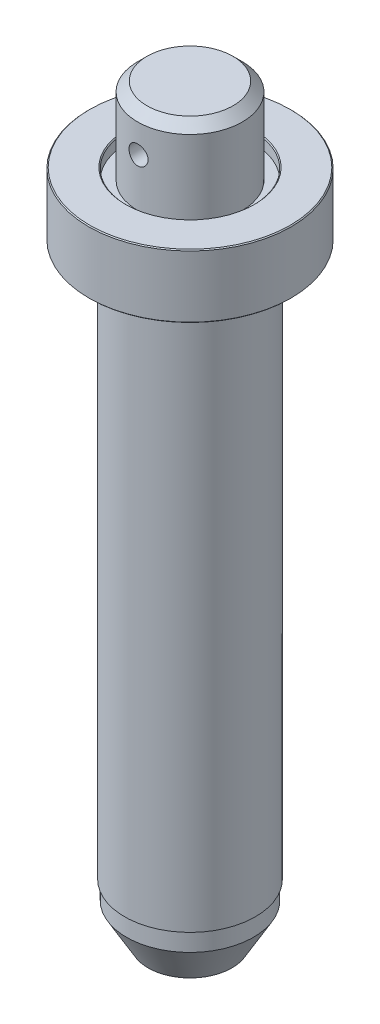
ISO-10303-21;
HEADER;
FILE_DESCRIPTION(('STEP AP214'),'2;1');
FILE_NAME('part.step','',(''),(''),'','','');
FILE_SCHEMA(('AUTOMOTIVE_DESIGN { 1 0 10303 214 1 1 1 1 }'));
ENDSEC;
DATA;
#1=APPLICATION_CONTEXT('core data for automotive mechanical design processes');
#2=APPLICATION_PROTOCOL_DEFINITION('international standard','automotive_design',2000,#1);
#3=PRODUCT_CONTEXT('',#1,'mechanical');
#4=PRODUCT('Part','Part','',(#3));
#5=PRODUCT_RELATED_PRODUCT_CATEGORY('part','',(#4));
#6=PRODUCT_DEFINITION_FORMATION('','',#4);
#7=PRODUCT_DEFINITION_CONTEXT('part definition',#1,'design');
#8=PRODUCT_DEFINITION('design','',#6,#7);
#9=PRODUCT_DEFINITION_SHAPE('','',#8);
#10=(LENGTH_UNIT() NAMED_UNIT(*) SI_UNIT(.MILLI.,.METRE.));
#11=(NAMED_UNIT(*) PLANE_ANGLE_UNIT() SI_UNIT($,.RADIAN.));
#12=(NAMED_UNIT(*) SI_UNIT($,.STERADIAN.) SOLID_ANGLE_UNIT());
#13=UNCERTAINTY_MEASURE_WITH_UNIT(LENGTH_MEASURE(1.E-05),#10,'distance_accuracy_value','');
#14=(GEOMETRIC_REPRESENTATION_CONTEXT(3) GLOBAL_UNCERTAINTY_ASSIGNED_CONTEXT((#13)) GLOBAL_UNIT_ASSIGNED_CONTEXT((#10,
#11,#12)) REPRESENTATION_CONTEXT('',''));
#15=CARTESIAN_POINT('',(0.,0.,0.));
#16=DIRECTION('',(0.,0.,1.));
#17=DIRECTION('',(1.,0.,0.));
#18=AXIS2_PLACEMENT_3D('',#15,#16,#17);
#19=CARTESIAN_POINT('',(0.,0.,0.));
#20=DIRECTION('',(0.,-1.,0.));
#21=DIRECTION('',(0.,0.,-1.));
#22=AXIS2_PLACEMENT_3D('',#19,#20,#21);
#23=PLANE('',#22);
#24=CARTESIAN_POINT('',(0.,0.,0.));
#25=DIRECTION('',(0.,-1.,0.));
#26=DIRECTION('',(0.,0.,-1.));
#27=AXIS2_PLACEMENT_3D('',#24,#25,#26);
#28=CIRCLE('',#27,11.2264973081038);
#29=CARTESIAN_POINT('',(0.,0.,-11.2264973081038));
#30=VERTEX_POINT('',#29);
#31=EDGE_CURVE('E119',#30,#30,#28,.T.);
#32=ORIENTED_EDGE('',*,*,#31,.T.);
#33=EDGE_LOOP('',(#32));
#34=FACE_BOUND('',#33,.T.);
#35=ADVANCED_FACE('F34',(#34),#23,.T.);
#36=CARTESIAN_POINT('',(0.,0.,0.));
#37=DIRECTION('',(0.,1.,0.));
#38=DIRECTION('',(0.,0.,1.));
#39=AXIS2_PLACEMENT_3D('',#36,#37,#38);
#40=CONICAL_SURFACE('',#39,11.2264973081038,0.523598775598293);
#41=CARTESIAN_POINT('',(0.,10.,0.));
#42=DIRECTION('',(0.,-1.,0.));
#43=DIRECTION('',(0.,0.,-1.));
#44=AXIS2_PLACEMENT_3D('',#41,#42,#43);
#45=CIRCLE('',#44,17.);
#46=CARTESIAN_POINT('',(0.,10.,-17.));
#47=VERTEX_POINT('',#46);
#48=EDGE_CURVE('E121',#47,#47,#45,.T.);
#49=ORIENTED_EDGE('',*,*,#48,.T.);
#50=EDGE_LOOP('',(#49));
#51=FACE_BOUND('',#50,.T.);
#52=ORIENTED_EDGE('',*,*,#31,.F.);
#53=EDGE_LOOP('',(#52));
#54=FACE_BOUND('',#53,.T.);
#55=ADVANCED_FACE('F83',(#51,#54),#40,.T.);
#56=CARTESIAN_POINT('',(0.,0.,0.));
#57=DIRECTION('',(0.,-1.,0.));
#58=DIRECTION('',(0.,0.,-1.));
#59=AXIS2_PLACEMENT_3D('',#56,#57,#58);
#60=CYLINDRICAL_SURFACE('',#59,17.);
#61=CARTESIAN_POINT('',(0.,15.,0.));
#62=DIRECTION('',(0.,-1.,0.));
#63=DIRECTION('',(0.,0.,-1.));
#64=AXIS2_PLACEMENT_3D('',#61,#62,#63);
#65=CIRCLE('',#64,17.);
#66=CARTESIAN_POINT('',(0.,15.,-17.));
#67=VERTEX_POINT('',#66);
#68=EDGE_CURVE('E124',#67,#67,#65,.T.);
#69=ORIENTED_EDGE('',*,*,#68,.T.);
#70=EDGE_LOOP('',(#69));
#71=FACE_BOUND('',#70,.T.);
#72=ORIENTED_EDGE('',*,*,#48,.F.);
#73=EDGE_LOOP('',(#72));
#74=FACE_BOUND('',#73,.T.);
#75=ADVANCED_FACE('F89',(#71,#74),#60,.T.);
#76=CARTESIAN_POINT('',(17.,15.,0.));
#77=DIRECTION('',(0.,-1.,0.));
#78=DIRECTION('',(0.,0.,-1.));
#79=AXIS2_PLACEMENT_3D('',#76,#77,#78);
#80=PLANE('',#79);
#81=CARTESIAN_POINT('',(0.,15.,0.));
#82=DIRECTION('',(0.,-1.,0.));
#83=DIRECTION('',(0.,0.,-1.));
#84=AXIS2_PLACEMENT_3D('',#81,#82,#83);
#85=CIRCLE('',#84,17.5);
#86=CARTESIAN_POINT('',(0.,15.,-17.5));
#87=VERTEX_POINT('',#86);
#88=EDGE_CURVE('E127',#87,#87,#85,.T.);
#89=ORIENTED_EDGE('',*,*,#88,.T.);
#90=EDGE_LOOP('',(#89));
#91=FACE_BOUND('',#90,.T.);
#92=ORIENTED_EDGE('',*,*,#68,.F.);
#93=EDGE_LOOP('',(#92));
#94=FACE_BOUND('',#93,.T.);
#95=ADVANCED_FACE('F185',(#91,#94),#80,.T.);
#96=CARTESIAN_POINT('',(0.,0.,0.));
#97=DIRECTION('',(0.,-1.,0.));
#98=DIRECTION('',(0.,0.,-1.));
#99=AXIS2_PLACEMENT_3D('',#96,#97,#98);
#100=CYLINDRICAL_SURFACE('',#99,17.5);
#101=CARTESIAN_POINT('',(0.,158.,0.));
#102=DIRECTION('',(0.,-1.,0.));
#103=DIRECTION('',(0.,0.,-1.));
#104=AXIS2_PLACEMENT_3D('',#101,#102,#103);
#105=CIRCLE('',#104,17.5);
#106=CARTESIAN_POINT('',(0.,158.,-17.5));
#107=VERTEX_POINT('',#106);
#108=EDGE_CURVE('E130',#107,#107,#105,.T.);
#109=ORIENTED_EDGE('',*,*,#108,.T.);
#110=EDGE_LOOP('',(#109));
#111=FACE_BOUND('',#110,.T.);
#112=ORIENTED_EDGE('',*,*,#88,.F.);
#113=EDGE_LOOP('',(#112));
#114=FACE_BOUND('',#113,.T.);
#115=ADVANCED_FACE('F181',(#111,#114),#100,.T.);
#116=CARTESIAN_POINT('',(0.,158.,0.));
#117=DIRECTION('',(0.,-1.,0.));
#118=DIRECTION('',(0.,0.,-1.));
#119=AXIS2_PLACEMENT_3D('',#116,#117,#118);
#120=TOROIDAL_SURFACE('',#119,22.5,5.);
#121=CARTESIAN_POINT('',(0.,163.,0.));
#122=DIRECTION('',(0.,-1.,0.));
#123=DIRECTION('',(0.,0.,-1.));
#124=AXIS2_PLACEMENT_3D('',#121,#122,#123);
#125=CIRCLE('',#124,22.5);
#126=CARTESIAN_POINT('',(0.,163.,-22.5));
#127=VERTEX_POINT('',#126);
#128=EDGE_CURVE('E133',#127,#127,#125,.T.);
#129=ORIENTED_EDGE('',*,*,#128,.T.);
#130=EDGE_LOOP('',(#129));
#131=FACE_BOUND('',#130,.T.);
#132=ORIENTED_EDGE('',*,*,#108,.F.);
#133=EDGE_LOOP('',(#132));
#134=FACE_BOUND('',#133,.T.);
#135=ADVANCED_FACE('F178',(#131,#134),#120,.F.);
#136=CARTESIAN_POINT('',(22.5,163.,0.));
#137=DIRECTION('',(0.,-1.,0.));
#138=DIRECTION('',(0.,0.,-1.));
#139=AXIS2_PLACEMENT_3D('',#136,#137,#138);
#140=PLANE('',#139);
#141=CARTESIAN_POINT('',(0.,163.,0.));
#142=DIRECTION('',(0.,-1.,0.));
#143=DIRECTION('',(0.,0.,-1.));
#144=AXIS2_PLACEMENT_3D('',#141,#142,#143);
#145=CIRCLE('',#144,26.85);
#146=CARTESIAN_POINT('',(0.,163.,-26.85));
#147=VERTEX_POINT('',#146);
#148=EDGE_CURVE('E109',#147,#147,#145,.T.);
#149=ORIENTED_EDGE('',*,*,#148,.T.);
#150=EDGE_LOOP('',(#149));
#151=FACE_BOUND('',#150,.T.);
#152=ORIENTED_EDGE('',*,*,#128,.F.);
#153=EDGE_LOOP('',(#152));
#154=FACE_BOUND('',#153,.T.);
#155=ADVANCED_FACE('F174',(#151,#154),#140,.T.);
#156=CARTESIAN_POINT('',(0.,0.,0.));
#157=DIRECTION('',(0.,-1.,0.));
#158=DIRECTION('',(0.,0.,-1.));
#159=AXIS2_PLACEMENT_3D('',#156,#157,#158);
#160=CYLINDRICAL_SURFACE('',#159,27.1);
#161=CARTESIAN_POINT('',(0.,163.25,0.));
#162=DIRECTION('',(0.,-1.,0.));
#163=DIRECTION('',(0.,0.,-1.));
#164=AXIS2_PLACEMENT_3D('',#161,#162,#163);
#165=CIRCLE('',#164,27.1);
#166=CARTESIAN_POINT('',(0.,163.25,-27.1));
#167=VERTEX_POINT('',#166);
#168=EDGE_CURVE('E51',#167,#167,#165,.F.);
#169=ORIENTED_EDGE('',*,*,#168,.T.);
#170=EDGE_LOOP('',(#169));
#171=FACE_BOUND('',#170,.T.);
#172=CARTESIAN_POINT('',(0.,179.75,0.));
#173=DIRECTION('',(0.,1.,0.));
#174=DIRECTION('',(0.,0.,1.));
#175=AXIS2_PLACEMENT_3D('',#172,#173,#174);
#176=CIRCLE('',#175,27.1);
#177=CARTESIAN_POINT('',(0.,179.75,27.1));
#178=VERTEX_POINT('',#177);
#179=EDGE_CURVE('E114',#178,#178,#176,.F.);
#180=ORIENTED_EDGE('',*,*,#179,.T.);
#181=EDGE_LOOP('',(#180));
#182=FACE_BOUND('',#181,.T.);
#183=ADVANCED_FACE('F168',(#171,#182),#160,.T.);
#184=CARTESIAN_POINT('',(17.,180.,0.));
#185=DIRECTION('',(0.,1.,0.));
#186=DIRECTION('',(0.,0.,1.));
#187=AXIS2_PLACEMENT_3D('',#184,#185,#186);
#188=PLANE('',#187);
#189=CARTESIAN_POINT('',(0.,180.,0.));
#190=DIRECTION('',(0.,1.,0.));
#191=DIRECTION('',(0.,0.,1.));
#192=AXIS2_PLACEMENT_3D('',#189,#190,#191);
#193=CIRCLE('',#192,17.25);
#194=CARTESIAN_POINT('',(0.,180.,17.25));
#195=VERTEX_POINT('',#194);
#196=EDGE_CURVE('E46',#195,#195,#193,.F.);
#197=ORIENTED_EDGE('',*,*,#196,.T.);
#198=EDGE_LOOP('',(#197));
#199=FACE_BOUND('',#198,.T.);
#200=CARTESIAN_POINT('',(0.,180.,0.));
#201=DIRECTION('',(0.,1.,0.));
#202=DIRECTION('',(0.,0.,1.));
#203=AXIS2_PLACEMENT_3D('',#200,#201,#202);
#204=CIRCLE('',#203,26.85);
#205=CARTESIAN_POINT('',(0.,180.,26.85));
#206=VERTEX_POINT('',#205);
#207=EDGE_CURVE('E111',#206,#206,#204,.T.);
#208=ORIENTED_EDGE('',*,*,#207,.T.);
#209=EDGE_LOOP('',(#208));
#210=FACE_BOUND('',#209,.T.);
#211=ADVANCED_FACE('F163',(#199,#210),#188,.T.);
#212=CARTESIAN_POINT('',(0.,0.,0.));
#213=DIRECTION('',(0.,-1.,0.));
#214=DIRECTION('',(0.,0.,-1.));
#215=AXIS2_PLACEMENT_3D('',#212,#213,#214);
#216=CYLINDRICAL_SURFACE('',#215,17.);
#217=CARTESIAN_POINT('',(0.,179.75,0.));
#218=DIRECTION('',(0.,1.,0.));
#219=DIRECTION('',(0.,0.,1.));
#220=AXIS2_PLACEMENT_3D('',#217,#218,#219);
#221=CIRCLE('',#220,17.);
#222=CARTESIAN_POINT('',(0.,179.75,17.));
#223=VERTEX_POINT('',#222);
#224=EDGE_CURVE('E10',#223,#223,#221,.T.);
#225=ORIENTED_EDGE('',*,*,#224,.T.);
#226=EDGE_LOOP('',(#225));
#227=FACE_BOUND('',#226,.T.);
#228=CARTESIAN_POINT('',(0.,177.,0.));
#229=DIRECTION('',(0.,-1.,0.));
#230=DIRECTION('',(0.,0.,-1.));
#231=AXIS2_PLACEMENT_3D('',#228,#229,#230);
#232=CIRCLE('',#231,17.);
#233=CARTESIAN_POINT('',(0.,177.,-17.));
#234=VERTEX_POINT('',#233);
#235=EDGE_CURVE('E136',#234,#234,#232,.T.);
#236=ORIENTED_EDGE('',*,*,#235,.T.);
#237=EDGE_LOOP('',(#236));
#238=FACE_BOUND('',#237,.T.);
#239=ADVANCED_FACE('F159',(#227,#238),#216,.F.);
#240=CARTESIAN_POINT('',(14.,177.,0.));
#241=DIRECTION('',(0.,1.,0.));
#242=DIRECTION('',(0.,0.,1.));
#243=AXIS2_PLACEMENT_3D('',#240,#241,#242);
#244=PLANE('',#243);
#245=CARTESIAN_POINT('',(0.,177.,0.));
#246=DIRECTION('',(0.,-1.,0.));
#247=DIRECTION('',(0.,0.,-1.));
#248=AXIS2_PLACEMENT_3D('',#245,#246,#247);
#249=CIRCLE('',#248,14.);
#250=CARTESIAN_POINT('',(0.,177.,-14.));
#251=VERTEX_POINT('',#250);
#252=EDGE_CURVE('E139',#251,#251,#249,.T.);
#253=ORIENTED_EDGE('',*,*,#252,.T.);
#254=EDGE_LOOP('',(#253));
#255=FACE_BOUND('',#254,.T.);
#256=ORIENTED_EDGE('',*,*,#235,.F.);
#257=EDGE_LOOP('',(#256));
#258=FACE_BOUND('',#257,.T.);
#259=ADVANCED_FACE('F78',(#255,#258),#244,.T.);
#260=CARTESIAN_POINT('',(0.,0.,0.));
#261=DIRECTION('',(0.,-1.,0.));
#262=DIRECTION('',(0.,0.,-1.));
#263=AXIS2_PLACEMENT_3D('',#260,#261,#262);
#264=CYLINDRICAL_SURFACE('',#263,14.);
#265=CARTESIAN_POINT('',(0.,192.425,-14.));
#266=CARTESIAN_POINT('',(0.141976094489852,192.424994498335,-13.9999974574589));
#267=CARTESIAN_POINT('',(0.284024632016118,192.413102751017,-13.9978179467819));
#268=CARTESIAN_POINT('',(0.564123899293587,192.365877674065,-13.989333465136));
#269=CARTESIAN_POINT('',(0.702171066283989,192.33052408534,-13.983024928855));
#270=CARTESIAN_POINT('',(0.970175799636657,192.23748961157,-13.9669885946249));
#271=CARTESIAN_POINT('',(1.10014037201553,192.179828385007,-13.9572638079197));
#272=CARTESIAN_POINT('',(1.34853719862439,192.043870102177,-13.9354588657755));
#273=CARTESIAN_POINT('',(1.46697048738563,191.965574899431,-13.9233789219225));
#274=CARTESIAN_POINT('',(1.69029797747903,191.789628949861,-13.8980455116765));
#275=CARTESIAN_POINT('',(1.79504260537423,191.691789865698,-13.8847813814236));
#276=CARTESIAN_POINT('',(1.98672600637303,191.479938669334,-13.8586543499962));
#277=CARTESIAN_POINT('',(2.07366354367529,191.365925435587,-13.8457914767212));
#278=CARTESIAN_POINT('',(2.22788102248421,191.123913141507,-13.821819822612));
#279=CARTESIAN_POINT('',(2.29500993873686,190.995816360876,-13.8107248005582));
#280=CARTESIAN_POINT('',(2.40673810964499,190.729927876177,-13.7916947549162));
#281=CARTESIAN_POINT('',(2.45133919306592,190.592136960095,-13.7837594748375));
#282=CARTESIAN_POINT('',(2.51626791842283,190.312368165869,-13.7720544212343));
#283=CARTESIAN_POINT('',(2.53685573125852,190.170452571255,-13.7682400340787));
#284=CARTESIAN_POINT('',(2.55398082282255,189.885134045281,-13.7650740280158));
#285=CARTESIAN_POINT('',(2.55052013559245,189.741731240734,-13.765722031676));
#286=CARTESIAN_POINT('',(2.51985768216466,189.459386407354,-13.7713669406541));
#287=CARTESIAN_POINT('',(2.49295079305917,189.320411116204,-13.7763098280887));
#288=CARTESIAN_POINT('',(2.41662367553237,189.048980851965,-13.7899027984476));
#289=CARTESIAN_POINT('',(2.36720253946837,188.916526141987,-13.7985530308294));
#290=CARTESIAN_POINT('',(2.24695861496892,188.661028807189,-13.8186430025016));
#291=CARTESIAN_POINT('',(2.17601585678882,188.538043917788,-13.8300983074759));
#292=CARTESIAN_POINT('',(2.01482742504758,188.305612573977,-13.8544972755391));
#293=CARTESIAN_POINT('',(1.92457989940525,188.196167420149,-13.8674410813784));
#294=CARTESIAN_POINT('',(1.72574937702895,187.992217705314,-13.8935945201448));
#295=CARTESIAN_POINT('',(1.61691394822143,187.897959207583,-13.9068052458102));
#296=CARTESIAN_POINT('',(1.38484415644009,187.729002073086,-13.9318270533405));
#297=CARTESIAN_POINT('',(1.26160966411668,187.654303612049,-13.94363812263));
#298=CARTESIAN_POINT('',(1.00399003907896,187.526554454839,-13.9645516782091));
#299=CARTESIAN_POINT('',(0.869592463462327,187.473528316096,-13.9736510887091));
#300=CARTESIAN_POINT('',(0.593595384681256,187.390872301841,-13.988092085283));
#301=CARTESIAN_POINT('',(0.451996604342619,187.361240083062,-13.9934340477182));
#302=CARTESIAN_POINT('',(0.167734582248122,187.326553158118,-13.9997068493637));
#303=CARTESIAN_POINT('',(0.0251137928746217,187.321161136465,-14.0006982246841));
#304=CARTESIAN_POINT('',(-0.2589918905785,187.334204329482,-13.9983249910562));
#305=CARTESIAN_POINT('',(-0.400476836895757,187.352638441992,-13.9949605835994));
#306=CARTESIAN_POINT('',(-0.677232177436341,187.412530134953,-13.9842914453998));
#307=CARTESIAN_POINT('',(-0.812540512533689,187.453818018981,-13.9770157683938));
#308=CARTESIAN_POINT('',(-1.0743146154713,187.558062340658,-13.9593364940552));
#309=CARTESIAN_POINT('',(-1.20077980905475,187.621020183944,-13.9489326938203));
#310=CARTESIAN_POINT('',(-1.44272421761504,187.767570800455,-13.926000282128));
#311=CARTESIAN_POINT('',(-1.55807581520451,187.851370919854,-13.91345074211));
#312=CARTESIAN_POINT('',(-1.77320020895572,188.036945502813,-13.8876751354776));
#313=CARTESIAN_POINT('',(-1.87297163638354,188.138721543904,-13.8744490095599));
#314=CARTESIAN_POINT('',(-2.05537693683646,188.358882329573,-13.8486114156175));
#315=CARTESIAN_POINT('',(-2.13778120634732,188.477458633411,-13.8360096875187));
#316=CARTESIAN_POINT('',(-2.28150163521955,188.72696890319,-13.8130398293156));
#317=CARTESIAN_POINT('',(-2.34281855009701,188.857902426182,-13.8026716191939));
#318=CARTESIAN_POINT('',(-2.44229335052976,189.127811719047,-13.7854182746129));
#319=CARTESIAN_POINT('',(-2.4805588889702,189.266746732356,-13.7785169747537));
#320=CARTESIAN_POINT('',(-2.53317867982252,189.549210660325,-13.7689409051812));
#321=CARTESIAN_POINT('',(-2.54753546136584,189.692739087444,-13.7662656884232));
#322=CARTESIAN_POINT('',(-2.55184931194479,189.978017738912,-13.7654664587921));
#323=CARTESIAN_POINT('',(-2.54216833098208,190.119762428227,-13.7672749318831));
#324=CARTESIAN_POINT('',(-2.49947127650064,190.399568494246,-13.7750900739301));
#325=CARTESIAN_POINT('',(-2.46645532413346,190.537629890069,-13.7810967210897));
#326=CARTESIAN_POINT('',(-2.37817455741317,190.805970234227,-13.7966037155391));
#327=CARTESIAN_POINT('',(-2.32294679755419,190.936261730944,-13.8060982419568));
#328=CARTESIAN_POINT('',(-2.19184900985056,191.185787766415,-13.8275156881824));
#329=CARTESIAN_POINT('',(-2.11597763801183,191.305021584587,-13.8394387660875));
#330=CARTESIAN_POINT('',(-1.94447898515047,191.530864993245,-13.8645806697771));
#331=CARTESIAN_POINT('',(-1.84858749331314,191.637272208566,-13.8778154352803));
#332=CARTESIAN_POINT('',(-1.64032345337745,191.832606876366,-13.9039681718916));
#333=CARTESIAN_POINT('',(-1.52794712188558,191.921530305191,-13.9168860694796));
#334=CARTESIAN_POINT('',(-1.28877104551741,192.080069426731,-13.9410768774511));
#335=CARTESIAN_POINT('',(-1.16185776214326,192.149516143612,-13.9523350122268));
#336=CARTESIAN_POINT('',(-0.898003982786515,192.265992365746,-13.9717937965753));
#337=CARTESIAN_POINT('',(-0.761073203503004,192.313043270266,-13.9799973631583));
#338=CARTESIAN_POINT('',(-0.519753015198589,192.373660848306,-13.9907183802566));
#339=CARTESIAN_POINT('',(-0.416788361736386,192.3928806919,-13.9941796165895));
#340=CARTESIAN_POINT('',(-0.209228896148138,192.418552148004,-13.9988213370979));
#341=CARTESIAN_POINT('',(-0.104634121630019,192.42500405464,-14.0000018738123));
#342=CARTESIAN_POINT('',(0.,192.425,-14.));
#343=B_SPLINE_CURVE_WITH_KNOTS('',3,(#265,#266,#267,#268,#269,#270,#271,#272,#273,#274,#275,
#276,#277,#278,#279,#280,#281,#282,#283,#284,#285,#286,#287,#288,#289,#290,#291,#292,#293,#294,
#295,#296,#297,#298,#299,#300,#301,#302,#303,#304,#305,#306,#307,#308,#309,#310,#311,#312,#313,
#314,#315,#316,#317,#318,#319,#320,#321,#322,#323,#324,#325,#326,#327,#328,#329,#330,#331,#332,
#333,#334,#335,#336,#337,#338,#339,#340,#341,#342),.UNSPECIFIED.,.T.,.F.,(4,2,2,2,2,2,2,2,2,2,2,
2,2,2,2,2,2,2,2,2,2,2,2,2,2,2,2,2,2,2,2,2,2,2,2,2,2,2,4),(0.,0.425545680606268,
0.851459295048432,1.27699842728804,1.70249934695979,2.13231777735256,2.56216602678617,
2.99521153546241,3.42822188469825,3.85649589121172,4.28473367440474,4.70766210712256,
5.13060759134922,5.55595546282534,5.98134416009235,6.41305129082103,6.84476229995698,
7.27696114399479,7.70911669107716,8.13523956167888,8.56134272123058,8.98432356979763,
9.40733186047761,9.83472964124751,10.2621649482529,10.6949387286013,11.127697001949,
11.5584182464124,11.9890939251506,12.4133241197159,12.8375521117602,13.2610753084469,
13.6846260850418,14.1141666380787,14.543805928558,14.9770648540174,15.4099089640871,
15.7235365816652,16.0371569743354),.UNSPECIFIED.);
#344=CARTESIAN_POINT('',(0.,192.425,-14.));
#345=VERTEX_POINT('',#344);
#346=EDGE_CURVE('E38',#345,#345,#343,.T.);
#347=ORIENTED_EDGE('',*,*,#346,.F.);
#348=EDGE_LOOP('',(#347));
#349=FACE_BOUND('',#348,.T.);
#350=CARTESIAN_POINT('',(2.55,189.875,13.7658090935477));
#351=CARTESIAN_POINT('',(2.54999448056261,190.016954073512,13.7658117998555));
#352=CARTESIAN_POINT('',(2.53810629720817,190.158980640705,13.7680286871634));
#353=CARTESIAN_POINT('',(2.49089665962551,190.439034281151,13.7766464647047));
#354=CARTESIAN_POINT('',(2.45555486345037,190.577057773874,13.783050986915));
#355=CARTESIAN_POINT('',(2.36255486998395,190.845012386459,13.7992951537537));
#356=CARTESIAN_POINT('',(2.30491688649849,190.97495071285,13.8091316861194));
#357=CARTESIAN_POINT('',(2.16901338243156,191.223303348303,13.8311278632272));
#358=CARTESIAN_POINT('',(2.09074966091124,191.341718661217,13.8432873053302));
#359=CARTESIAN_POINT('',(1.91483588560743,191.56506555928,13.8687188442348));
#360=CARTESIAN_POINT('',(1.81699043124366,191.669842084414,13.8820013061648));
#361=CARTESIAN_POINT('',(1.60511298555101,191.86158730207,13.9080906010728));
#362=CARTESIAN_POINT('',(1.49107996079625,191.94855485679,13.9208974036185));
#363=CARTESIAN_POINT('',(1.24904944527419,192.10280444513,13.9447030970338));
#364=CARTESIAN_POINT('',(1.12095763831355,192.169940772187,13.9556883581853));
#365=CARTESIAN_POINT('',(0.855079927498034,192.281684004331,13.9744973831681));
#366=CARTESIAN_POINT('',(0.717294776684035,192.326292657315,13.9823213922679));
#367=CARTESIAN_POINT('',(0.437547256687571,192.39123614423,13.9938531577304));
#368=CARTESIAN_POINT('',(0.295647376615787,192.411832164883,13.9976051737551));
#369=CARTESIAN_POINT('',(0.0103598878489102,192.428979121604,14.0007226255168));
#370=CARTESIAN_POINT('',(-0.133027600072892,192.425531994625,14.0000884146152));
#371=CARTESIAN_POINT('',(-0.415430314701068,192.394891724318,13.9945395783677));
#372=CARTESIAN_POINT('',(-0.554477189909806,192.3679797741,13.9896756421829));
#373=CARTESIAN_POINT('',(-0.826047978405519,192.291617995557,13.9762706186333));
#374=CARTESIAN_POINT('',(-0.958571663833348,192.242167380561,13.9677294029201));
#375=CARTESIAN_POINT('',(-1.21415535796131,192.121860997789,13.9478443498595));
#376=CARTESIAN_POINT('',(-1.33716082404451,192.050891899993,13.9364857333657));
#377=CARTESIAN_POINT('',(-1.5696222987096,191.889646475688,13.9122236063327));
#378=CARTESIAN_POINT('',(-1.67907700265893,191.799368292428,13.8993199472758));
#379=CARTESIAN_POINT('',(-1.88299478675364,191.600515088743,13.8731780920657));
#380=CARTESIAN_POINT('',(-1.97721790511322,191.491694116064,13.859937757188));
#381=CARTESIAN_POINT('',(-2.1461104147092,191.259666170031,13.8347939364111));
#382=CARTESIAN_POINT('',(-2.22077955075694,191.13645900896,13.82289046796));
#383=CARTESIAN_POINT('',(-2.3485071791135,190.878848656622,13.8017655272642));
#384=CARTESIAN_POINT('',(-2.40153240837301,190.744428611969,13.7925481893224));
#385=CARTESIAN_POINT('',(-2.48417980856756,190.468382426519,13.7779036781271));
#386=CARTESIAN_POINT('',(-2.51380447077741,190.326757054526,13.7724761014145));
#387=CARTESIAN_POINT('',(-2.54846280038594,190.042479775192,13.7661050171599));
#388=CARTESIAN_POINT('',(-2.55384049886719,189.899871174882,13.7650987821258));
#389=CARTESIAN_POINT('',(-2.5407730125998,189.615793234709,13.7675166626003));
#390=CARTESIAN_POINT('',(-2.52232893616139,189.474323842152,13.770940571996));
#391=CARTESIAN_POINT('',(-2.46243627135651,189.197660861926,13.7817746499346));
#392=CARTESIAN_POINT('',(-2.42116662828682,189.062427212273,13.7891537969264));
#393=CARTESIAN_POINT('',(-2.31698360082198,188.800794473536,13.8070403687419));
#394=CARTESIAN_POINT('',(-2.25406870013559,188.674396004119,13.8175480127156));
#395=CARTESIAN_POINT('',(-2.10758388985969,188.432501831359,13.8406512577694));
#396=CARTESIAN_POINT('',(-2.02379580991364,188.317140343853,13.8532684179122));
#397=CARTESIAN_POINT('',(-1.83823866866234,188.101990447242,13.8791077819695));
#398=CARTESIAN_POINT('',(-1.73646808566361,188.002203357402,13.8923300370175));
#399=CARTESIAN_POINT('',(-1.51630155867903,187.81975734178,13.9180905091455));
#400=CARTESIAN_POINT('',(-1.39771286272029,187.737329276506,13.9306180494198));
#401=CARTESIAN_POINT('',(-1.14817079961621,187.593567151723,13.9534002475474));
#402=CARTESIAN_POINT('',(-1.01721788951148,187.532232312895,13.9636549893673));
#403=CARTESIAN_POINT('',(-0.747315322723979,187.432746988137,13.9806901124785));
#404=CARTESIAN_POINT('',(-0.608409322436394,187.394481147181,13.9874877536041));
#405=CARTESIAN_POINT('',(-0.326007139031594,187.341850946243,13.996916222201));
#406=CARTESIAN_POINT('',(-0.182511411944495,187.327484219145,13.9995474623374));
#407=CARTESIAN_POINT('',(0.102779202368647,187.323138661048,14.0003390896836));
#408=CARTESIAN_POINT('',(0.244568709573991,187.33281047484,13.9985635221271));
#409=CARTESIAN_POINT('',(0.52446683875365,187.3755048538,13.9908734912559));
#410=CARTESIAN_POINT('',(0.662575491813677,187.408527221701,13.9849590629064));
#411=CARTESIAN_POINT('',(0.93102050843284,187.496841540644,13.9696550782508));
#412=CARTESIAN_POINT('',(1.06136878525925,187.552098290937,13.960271016851));
#413=CARTESIAN_POINT('',(1.31099647734879,187.68327181712,13.9390458756777));
#414=CARTESIAN_POINT('',(1.43027520696069,187.759189871633,13.9272046438532));
#415=CARTESIAN_POINT('',(1.65612405283978,187.930743225472,13.9021708874971));
#416=CARTESIAN_POINT('',(1.76249995685153,188.026631877317,13.8889622198763));
#417=CARTESIAN_POINT('',(1.95777276814058,188.234876922719,13.862786749587));
#418=CARTESIAN_POINT('',(2.04666556624286,188.347237176906,13.8498200044258));
#419=CARTESIAN_POINT('',(2.20516760903284,188.586397036128,13.8254743113516));
#420=CARTESIAN_POINT('',(2.27460336828501,188.713313153386,13.8141100708321));
#421=CARTESIAN_POINT('',(2.3910583448879,188.977172137317,13.7944320985374));
#422=CARTESIAN_POINT('',(2.43809905530967,189.114105244206,13.7861154436933));
#423=CARTESIAN_POINT('',(2.498691065523,189.355398986747,13.7752382513981));
#424=CARTESIAN_POINT('',(2.51789951536615,189.45833316548,13.7717229508052));
#425=CARTESIAN_POINT('',(2.54355585947755,189.665831801548,13.7670074031945));
#426=CARTESIAN_POINT('',(2.55000406718881,189.770396218775,13.7658070993109));
#427=CARTESIAN_POINT('',(2.55,189.875,13.7658090935477));
#428=B_SPLINE_CURVE_WITH_KNOTS('',3,(#350,#351,#352,#353,#354,#355,#356,#357,#358,#359,#360,
#361,#362,#363,#364,#365,#366,#367,#368,#369,#370,#371,#372,#373,#374,#375,#376,#377,#378,#379,
#380,#381,#382,#383,#384,#385,#386,#387,#388,#389,#390,#391,#392,#393,#394,#395,#396,#397,#398,
#399,#400,#401,#402,#403,#404,#405,#406,#407,#408,#409,#410,#411,#412,#413,#414,#415,#416,#417,
#418,#419,#420,#421,#422,#423,#424,#425,#426,#427),.UNSPECIFIED.,.T.,.F.,(4,2,2,2,2,2,2,2,2,2,2,
2,2,2,2,2,2,2,2,2,2,2,2,2,2,2,2,2,2,2,2,2,2,2,2,2,2,2,4),(0.,0.425479499734526,
0.851328512391758,1.27679235018874,1.70221908956643,2.13212414437859,2.56205665698522,
2.99507364386108,3.42805702827863,3.85628554463138,4.28447956262418,4.70761172369757,
5.1307586545717,5.55617404009407,5.9816303517175,6.41324571663088,6.84486671404715,
7.27714856535036,7.70938438879088,8.1354676761663,8.56153114069222,8.98430079926051,
9.4071000796754,9.83451896044907,10.2619740270793,10.6947976897693,11.1276053594812,
11.5582304531561,11.9888128925095,12.4131743151723,12.8375321528627,13.2612207878943,
13.6849356488425,14.1143947876662,14.5439547449241,14.9772310460278,15.4100906788937,
15.7236277033033,16.0371570258837),.UNSPECIFIED.);
#429=CARTESIAN_POINT('',(2.55,189.875,13.7658090935477));
#430=VERTEX_POINT('',#429);
#431=EDGE_CURVE('E54',#430,#430,#428,.T.);
#432=ORIENTED_EDGE('',*,*,#431,.F.);
#433=EDGE_LOOP('',(#432));
#434=FACE_BOUND('',#433,.T.);
#435=CARTESIAN_POINT('',(0.,197.5,0.));
#436=DIRECTION('',(0.,-1.,0.));
#437=DIRECTION('',(0.,0.,-1.));
#438=AXIS2_PLACEMENT_3D('',#435,#436,#437);
#439=CIRCLE('',#438,14.);
#440=CARTESIAN_POINT('',(0.,197.5,-14.));
#441=VERTEX_POINT('',#440);
#442=EDGE_CURVE('E142',#441,#441,#439,.T.);
#443=ORIENTED_EDGE('',*,*,#442,.T.);
#444=EDGE_LOOP('',(#443));
#445=FACE_BOUND('',#444,.T.);
#446=ORIENTED_EDGE('',*,*,#252,.F.);
#447=EDGE_LOOP('',(#446));
#448=FACE_BOUND('',#447,.T.);
#449=ADVANCED_FACE('F58',(#349,#434,#445,#448),#264,.T.);
#450=CARTESIAN_POINT('',(0.,197.5,0.));
#451=DIRECTION('',(0.,-1.,0.));
#452=DIRECTION('',(0.,0.,-1.));
#453=AXIS2_PLACEMENT_3D('',#450,#451,#452);
#454=CONICAL_SURFACE('',#453,14.,0.785398163397448);
#455=CARTESIAN_POINT('',(0.,200.,0.));
#456=DIRECTION('',(0.,-1.,0.));
#457=DIRECTION('',(0.,0.,-1.));
#458=AXIS2_PLACEMENT_3D('',#455,#456,#457);
#459=CIRCLE('',#458,11.5);
#460=CARTESIAN_POINT('',(0.,200.,-11.5));
#461=VERTEX_POINT('',#460);
#462=EDGE_CURVE('E145',#461,#461,#459,.T.);
#463=ORIENTED_EDGE('',*,*,#462,.T.);
#464=EDGE_LOOP('',(#463));
#465=FACE_BOUND('',#464,.T.);
#466=ORIENTED_EDGE('',*,*,#442,.F.);
#467=EDGE_LOOP('',(#466));
#468=FACE_BOUND('',#467,.T.);
#469=ADVANCED_FACE('F71',(#465,#468),#454,.T.);
#470=CARTESIAN_POINT('',(0.,200.,0.));
#471=DIRECTION('',(0.,1.,0.));
#472=DIRECTION('',(0.,0.,1.));
#473=AXIS2_PLACEMENT_3D('',#470,#471,#472);
#474=PLANE('',#473);
#475=ORIENTED_EDGE('',*,*,#462,.F.);
#476=EDGE_LOOP('',(#475));
#477=FACE_BOUND('',#476,.T.);
#478=ADVANCED_FACE('F67',(#477),#474,.T.);
#479=CARTESIAN_POINT('',(0.,179.75,0.));
#480=DIRECTION('',(0.,-1.,0.));
#481=DIRECTION('',(0.,0.,-1.));
#482=AXIS2_PLACEMENT_3D('',#479,#480,#481);
#483=CONICAL_SURFACE('',#482,27.1,0.78539816339749);
#484=ORIENTED_EDGE('',*,*,#207,.F.);
#485=EDGE_LOOP('',(#484));
#486=FACE_BOUND('',#485,.T.);
#487=ORIENTED_EDGE('',*,*,#179,.F.);
#488=EDGE_LOOP('',(#487));
#489=FACE_BOUND('',#488,.T.);
#490=ADVANCED_FACE('F70',(#486,#489),#483,.T.);
#491=CARTESIAN_POINT('',(0.,163.,0.));
#492=DIRECTION('',(0.,1.,0.));
#493=DIRECTION('',(0.,0.,1.));
#494=AXIS2_PLACEMENT_3D('',#491,#492,#493);
#495=CONICAL_SURFACE('',#494,26.85,0.785398163397476);
#496=ORIENTED_EDGE('',*,*,#168,.F.);
#497=EDGE_LOOP('',(#496));
#498=FACE_BOUND('',#497,.T.);
#499=ORIENTED_EDGE('',*,*,#148,.F.);
#500=EDGE_LOOP('',(#499));
#501=FACE_BOUND('',#500,.T.);
#502=ADVANCED_FACE('F96',(#498,#501),#495,.T.);
#503=CARTESIAN_POINT('',(0.,180.,0.));
#504=DIRECTION('',(0.,1.,0.));
#505=DIRECTION('',(0.,0.,1.));
#506=AXIS2_PLACEMENT_3D('',#503,#504,#505);
#507=CONICAL_SURFACE('',#506,17.25,0.785398163397421);
#508=ORIENTED_EDGE('',*,*,#224,.F.);
#509=EDGE_LOOP('',(#508));
#510=FACE_BOUND('',#509,.T.);
#511=ORIENTED_EDGE('',*,*,#196,.F.);
#512=EDGE_LOOP('',(#511));
#513=FACE_BOUND('',#512,.T.);
#514=ADVANCED_FACE('F36',(#510,#513),#507,.F.);
#515=CARTESIAN_POINT('',(0.,189.875,-15.));
#516=DIRECTION('',(0.,0.,1.));
#517=DIRECTION('',(1.,0.,0.));
#518=AXIS2_PLACEMENT_3D('',#515,#516,#517);
#519=CYLINDRICAL_SURFACE('',#518,2.55);
#520=ORIENTED_EDGE('',*,*,#346,.T.);
#521=EDGE_LOOP('',(#520));
#522=FACE_BOUND('',#521,.T.);
#523=ORIENTED_EDGE('',*,*,#431,.T.);
#524=EDGE_LOOP('',(#523));
#525=FACE_BOUND('',#524,.T.);
#526=ADVANCED_FACE('F62',(#522,#525),#519,.F.);
#527=CLOSED_SHELL('',(#35,#55,#75,#95,#115,#135,#155,#183,#211,#239,#259,#449,#469,#478,#490,
#502,#514,#526));
#528=MANIFOLD_SOLID_BREP('B2',#527);
#529=ADVANCED_BREP_SHAPE_REPRESENTATION('',(#18,#528),#14);
#530=SHAPE_DEFINITION_REPRESENTATION(#9,#529);
ENDSEC;
END-ISO-10303-21;
